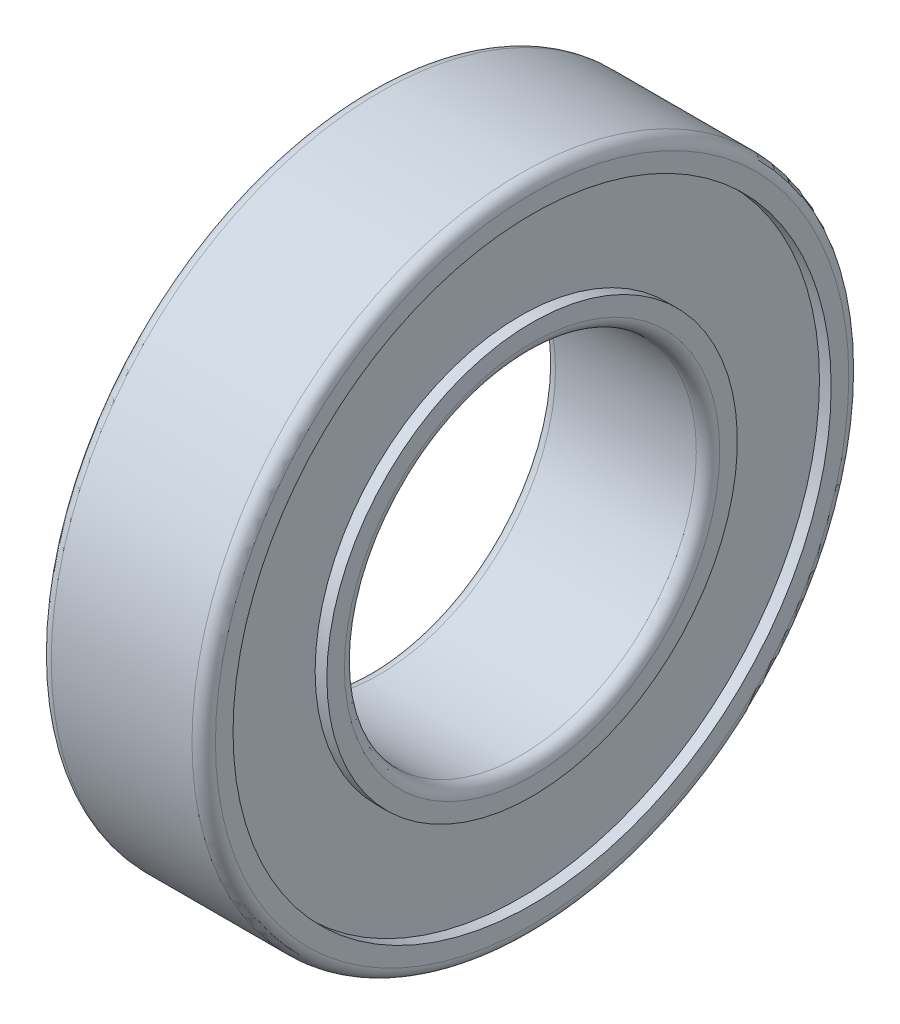
ISO-10303-21;
HEADER;
FILE_DESCRIPTION(('STEP AP214'),'2;1');
FILE_NAME('part.step','',(''),(''),'','','');
FILE_SCHEMA(('AUTOMOTIVE_DESIGN { 1 0 10303 214 1 1 1 1 }'));
ENDSEC;
DATA;
#1=APPLICATION_CONTEXT('core data for automotive mechanical design processes');
#2=APPLICATION_PROTOCOL_DEFINITION('international standard','automotive_design',2000,#1);
#3=PRODUCT_CONTEXT('',#1,'mechanical');
#4=PRODUCT('Part','Part','',(#3));
#5=PRODUCT_RELATED_PRODUCT_CATEGORY('part','',(#4));
#6=PRODUCT_DEFINITION_FORMATION('','',#4);
#7=PRODUCT_DEFINITION_CONTEXT('part definition',#1,'design');
#8=PRODUCT_DEFINITION('design','',#6,#7);
#9=PRODUCT_DEFINITION_SHAPE('','',#8);
#10=(LENGTH_UNIT() NAMED_UNIT(*) SI_UNIT(.MILLI.,.METRE.));
#11=(NAMED_UNIT(*) PLANE_ANGLE_UNIT() SI_UNIT($,.RADIAN.));
#12=(NAMED_UNIT(*) SI_UNIT($,.STERADIAN.) SOLID_ANGLE_UNIT());
#13=UNCERTAINTY_MEASURE_WITH_UNIT(LENGTH_MEASURE(1.E-05),#10,'distance_accuracy_value','');
#14=(GEOMETRIC_REPRESENTATION_CONTEXT(3) GLOBAL_UNCERTAINTY_ASSIGNED_CONTEXT((#13)) GLOBAL_UNIT_ASSIGNED_CONTEXT((#10,
#11,#12)) REPRESENTATION_CONTEXT('',''));
#15=CARTESIAN_POINT('',(0.,0.,0.));
#16=DIRECTION('',(0.,0.,1.));
#17=DIRECTION('',(1.,0.,0.));
#18=AXIS2_PLACEMENT_3D('',#15,#16,#17);
#19=CARTESIAN_POINT('',(0.5,12.75,0.));
#20=DIRECTION('',(1.,0.,0.));
#21=DIRECTION('',(0.,0.,-1.));
#22=AXIS2_PLACEMENT_3D('',#19,#20,#21);
#23=PLANE('',#22);
#24=CARTESIAN_POINT('',(0.5,0.,0.));
#25=DIRECTION('',(-1.,0.,0.));
#26=DIRECTION('',(0.,0.,1.));
#27=AXIS2_PLACEMENT_3D('',#24,#25,#26);
#28=CIRCLE('',#27,12.75);
#29=CARTESIAN_POINT('',(0.5,0.,12.75));
#30=VERTEX_POINT('',#29);
#31=EDGE_CURVE('E342',#30,#30,#28,.T.);
#32=ORIENTED_EDGE('',*,*,#31,.T.);
#33=EDGE_LOOP('',(#32));
#34=FACE_BOUND('',#33,.T.);
#35=CARTESIAN_POINT('',(0.5,0.,0.));
#36=DIRECTION('',(-1.,0.,0.));
#37=DIRECTION('',(0.,0.,1.));
#38=AXIS2_PLACEMENT_3D('',#35,#36,#37);
#39=CIRCLE('',#38,8.75);
#40=CARTESIAN_POINT('',(0.5,0.,8.75));
#41=VERTEX_POINT('',#40);
#42=EDGE_CURVE('E337',#41,#41,#39,.T.);
#43=ORIENTED_EDGE('',*,*,#42,.F.);
#44=EDGE_LOOP('',(#43));
#45=FACE_BOUND('',#44,.T.);
#46=ADVANCED_FACE('F16',(#34,#45),#23,.F.);
#47=CARTESIAN_POINT('',(0.,0.,0.));
#48=DIRECTION('',(-1.,0.,0.));
#49=DIRECTION('',(0.,0.,1.));
#50=AXIS2_PLACEMENT_3D('',#47,#48,#49);
#51=CYLINDRICAL_SURFACE('',#50,12.75);
#52=ORIENTED_EDGE('',*,*,#31,.F.);
#53=EDGE_LOOP('',(#52));
#54=FACE_BOUND('',#53,.T.);
#55=CARTESIAN_POINT('',(0.,0.,0.));
#56=DIRECTION('',(-1.,0.,0.));
#57=DIRECTION('',(0.,0.,1.));
#58=AXIS2_PLACEMENT_3D('',#55,#56,#57);
#59=CIRCLE('',#58,12.75);
#60=CARTESIAN_POINT('',(0.,0.,12.75));
#61=VERTEX_POINT('',#60);
#62=EDGE_CURVE('E333',#61,#61,#59,.T.);
#63=ORIENTED_EDGE('',*,*,#62,.T.);
#64=EDGE_LOOP('',(#63));
#65=FACE_BOUND('',#64,.T.);
#66=ADVANCED_FACE('F113',(#54,#65),#51,.F.);
#67=CARTESIAN_POINT('',(0.,0.,0.));
#68=DIRECTION('',(-1.,0.,0.));
#69=DIRECTION('',(0.,0.,1.));
#70=AXIS2_PLACEMENT_3D('',#67,#68,#69);
#71=CYLINDRICAL_SURFACE('',#70,8.75);
#72=CARTESIAN_POINT('',(0.,0.,0.));
#73=DIRECTION('',(-1.,0.,0.));
#74=DIRECTION('',(0.,0.,1.));
#75=AXIS2_PLACEMENT_3D('',#72,#73,#74);
#76=CIRCLE('',#75,8.75);
#77=CARTESIAN_POINT('',(0.,0.,8.75));
#78=VERTEX_POINT('',#77);
#79=EDGE_CURVE('E81',#78,#78,#76,.F.);
#80=ORIENTED_EDGE('',*,*,#79,.T.);
#81=EDGE_LOOP('',(#80));
#82=FACE_BOUND('',#81,.T.);
#83=ORIENTED_EDGE('',*,*,#42,.T.);
#84=EDGE_LOOP('',(#83));
#85=FACE_BOUND('',#84,.T.);
#86=ADVANCED_FACE('F101',(#82,#85),#71,.T.);
#87=CARTESIAN_POINT('',(0.,14.,0.));
#88=DIRECTION('',(1.,0.,0.));
#89=DIRECTION('',(0.,0.,-1.));
#90=AXIS2_PLACEMENT_3D('',#87,#88,#89);
#91=PLANE('',#90);
#92=ORIENTED_EDGE('',*,*,#62,.F.);
#93=EDGE_LOOP('',(#92));
#94=FACE_BOUND('',#93,.T.);
#95=CARTESIAN_POINT('',(0.,0.,0.));
#96=DIRECTION('',(1.,0.,0.));
#97=DIRECTION('',(0.,0.,-1.));
#98=AXIS2_PLACEMENT_3D('',#95,#96,#97);
#99=CIRCLE('',#98,13.5);
#100=CARTESIAN_POINT('',(0.,0.,-13.5));
#101=VERTEX_POINT('',#100);
#102=CARTESIAN_POINT('',(0.,0.,13.5));
#103=VERTEX_POINT('',#102);
#104=EDGE_CURVE('E65',#101,#103,#99,.T.);
#105=ORIENTED_EDGE('',*,*,#104,.F.);
#106=CARTESIAN_POINT('',(0.,0.,0.));
#107=DIRECTION('',(1.,0.,0.));
#108=DIRECTION('',(0.,0.,1.));
#109=AXIS2_PLACEMENT_3D('',#106,#107,#108);
#110=CIRCLE('',#109,13.5);
#111=EDGE_CURVE('E68',#103,#101,#110,.T.);
#112=ORIENTED_EDGE('',*,*,#111,.F.);
#113=EDGE_LOOP('',(#105,#112));
#114=FACE_BOUND('',#113,.T.);
#115=ADVANCED_FACE('F79',(#94,#114),#91,.F.);
#116=CARTESIAN_POINT('',(0.,8.75,0.));
#117=DIRECTION('',(1.,0.,0.));
#118=DIRECTION('',(0.,0.,-1.));
#119=AXIS2_PLACEMENT_3D('',#116,#117,#118);
#120=PLANE('',#119);
#121=ORIENTED_EDGE('',*,*,#79,.F.);
#122=EDGE_LOOP('',(#121));
#123=FACE_BOUND('',#122,.T.);
#124=CARTESIAN_POINT('',(0.,0.,0.));
#125=DIRECTION('',(-1.,0.,0.));
#126=DIRECTION('',(0.,0.,-1.));
#127=AXIS2_PLACEMENT_3D('',#124,#125,#126);
#128=CIRCLE('',#127,8.);
#129=CARTESIAN_POINT('',(0.,0.,-8.));
#130=VERTEX_POINT('',#129);
#131=CARTESIAN_POINT('',(0.,0.,8.));
#132=VERTEX_POINT('',#131);
#133=EDGE_CURVE('E75',#130,#132,#128,.T.);
#134=ORIENTED_EDGE('',*,*,#133,.F.);
#135=CARTESIAN_POINT('',(0.,0.,0.));
#136=DIRECTION('',(-1.,0.,0.));
#137=DIRECTION('',(0.,0.,1.));
#138=AXIS2_PLACEMENT_3D('',#135,#136,#137);
#139=CIRCLE('',#138,8.);
#140=EDGE_CURVE('E253',#132,#130,#139,.T.);
#141=ORIENTED_EDGE('',*,*,#140,.F.);
#142=EDGE_LOOP('',(#134,#141));
#143=FACE_BOUND('',#142,.T.);
#144=ADVANCED_FACE('F100',(#123,#143),#120,.F.);
#145=CARTESIAN_POINT('',(0.500000000000002,0.,0.));
#146=DIRECTION('',(1.,0.,0.));
#147=DIRECTION('',(0.,0.,-1.));
#148=AXIS2_PLACEMENT_3D('',#145,#146,#147);
#149=TOROIDAL_SURFACE('',#148,13.5,0.5);
#150=ORIENTED_EDGE('',*,*,#104,.T.);
#151=ORIENTED_EDGE('',*,*,#111,.T.);
#152=EDGE_LOOP('',(#150,#151));
#153=FACE_BOUND('',#152,.T.);
#154=CARTESIAN_POINT('',(0.500000000000002,0.,0.));
#155=DIRECTION('',(-1.,0.,0.));
#156=DIRECTION('',(0.,0.,1.));
#157=AXIS2_PLACEMENT_3D('',#154,#155,#156);
#158=CIRCLE('',#157,14.);
#159=CARTESIAN_POINT('',(0.500000000000002,0.,14.));
#160=VERTEX_POINT('',#159);
#161=EDGE_CURVE('E249',#160,#160,#158,.F.);
#162=ORIENTED_EDGE('',*,*,#161,.F.);
#163=EDGE_LOOP('',(#162));
#164=FACE_BOUND('',#163,.T.);
#165=ADVANCED_FACE('F70',(#153,#164),#149,.T.);
#166=CARTESIAN_POINT('',(0.5,0.,0.));
#167=DIRECTION('',(1.,0.,0.));
#168=DIRECTION('',(0.,0.,-1.));
#169=AXIS2_PLACEMENT_3D('',#166,#167,#168);
#170=TOROIDAL_SURFACE('',#169,8.,0.5);
#171=ORIENTED_EDGE('',*,*,#133,.T.);
#172=ORIENTED_EDGE('',*,*,#140,.T.);
#173=EDGE_LOOP('',(#171,#172));
#174=FACE_BOUND('',#173,.T.);
#175=CARTESIAN_POINT('',(0.5,0.,0.));
#176=DIRECTION('',(-1.,0.,0.));
#177=DIRECTION('',(0.,0.,1.));
#178=AXIS2_PLACEMENT_3D('',#175,#176,#177);
#179=CIRCLE('',#178,7.5);
#180=CARTESIAN_POINT('',(0.5,0.,7.5));
#181=VERTEX_POINT('',#180);
#182=EDGE_CURVE('E245',#181,#181,#179,.F.);
#183=ORIENTED_EDGE('',*,*,#182,.T.);
#184=EDGE_LOOP('',(#183));
#185=FACE_BOUND('',#184,.T.);
#186=ADVANCED_FACE('F230',(#174,#185),#170,.T.);
#187=CARTESIAN_POINT('',(0.,0.,0.));
#188=DIRECTION('',(-1.,0.,0.));
#189=DIRECTION('',(0.,0.,1.));
#190=AXIS2_PLACEMENT_3D('',#187,#188,#189);
#191=CYLINDRICAL_SURFACE('',#190,14.);
#192=CARTESIAN_POINT('',(6.5,0.,0.));
#193=DIRECTION('',(-1.,0.,0.));
#194=DIRECTION('',(0.,0.,1.));
#195=AXIS2_PLACEMENT_3D('',#192,#193,#194);
#196=CIRCLE('',#195,14.);
#197=CARTESIAN_POINT('',(6.5,0.,14.));
#198=VERTEX_POINT('',#197);
#199=EDGE_CURVE('E284',#198,#198,#196,.F.);
#200=ORIENTED_EDGE('',*,*,#199,.F.);
#201=EDGE_LOOP('',(#200));
#202=FACE_BOUND('',#201,.T.);
#203=ORIENTED_EDGE('',*,*,#161,.T.);
#204=EDGE_LOOP('',(#203));
#205=FACE_BOUND('',#204,.T.);
#206=ADVANCED_FACE('F239',(#202,#205),#191,.T.);
#207=CARTESIAN_POINT('',(0.,0.,0.));
#208=DIRECTION('',(-1.,0.,0.));
#209=DIRECTION('',(0.,0.,1.));
#210=AXIS2_PLACEMENT_3D('',#207,#208,#209);
#211=CYLINDRICAL_SURFACE('',#210,7.5);
#212=CARTESIAN_POINT('',(6.5,0.,0.));
#213=DIRECTION('',(-1.,0.,0.));
#214=DIRECTION('',(0.,0.,1.));
#215=AXIS2_PLACEMENT_3D('',#212,#213,#214);
#216=CIRCLE('',#215,7.5);
#217=CARTESIAN_POINT('',(6.5,0.,7.5));
#218=VERTEX_POINT('',#217);
#219=EDGE_CURVE('E281',#218,#218,#216,.T.);
#220=ORIENTED_EDGE('',*,*,#219,.F.);
#221=EDGE_LOOP('',(#220));
#222=FACE_BOUND('',#221,.T.);
#223=ORIENTED_EDGE('',*,*,#182,.F.);
#224=EDGE_LOOP('',(#223));
#225=FACE_BOUND('',#224,.T.);
#226=ADVANCED_FACE('F313',(#222,#225),#211,.F.);
#227=CARTESIAN_POINT('',(6.5,0.,0.));
#228=DIRECTION('',(-1.,0.,0.));
#229=DIRECTION('',(0.,0.,1.));
#230=AXIS2_PLACEMENT_3D('',#227,#228,#229);
#231=TOROIDAL_SURFACE('',#230,13.5,0.5);
#232=CARTESIAN_POINT('',(7.,0.,0.));
#233=DIRECTION('',(-1.,0.,0.));
#234=DIRECTION('',(0.,0.,1.));
#235=AXIS2_PLACEMENT_3D('',#232,#233,#234);
#236=CIRCLE('',#235,13.5);
#237=CARTESIAN_POINT('',(7.,0.,13.5));
#238=VERTEX_POINT('',#237);
#239=CARTESIAN_POINT('',(7.,0.,-13.5));
#240=VERTEX_POINT('',#239);
#241=EDGE_CURVE('E168',#238,#240,#236,.T.);
#242=ORIENTED_EDGE('',*,*,#241,.T.);
#243=CARTESIAN_POINT('',(7.,0.,0.));
#244=DIRECTION('',(-1.,0.,0.));
#245=DIRECTION('',(0.,0.,-1.));
#246=AXIS2_PLACEMENT_3D('',#243,#244,#245);
#247=CIRCLE('',#246,13.5);
#248=EDGE_CURVE('E179',#240,#238,#247,.T.);
#249=ORIENTED_EDGE('',*,*,#248,.T.);
#250=EDGE_LOOP('',(#242,#249));
#251=FACE_BOUND('',#250,.T.);
#252=ORIENTED_EDGE('',*,*,#199,.T.);
#253=EDGE_LOOP('',(#252));
#254=FACE_BOUND('',#253,.T.);
#255=ADVANCED_FACE('F195',(#251,#254),#231,.T.);
#256=CARTESIAN_POINT('',(6.5,0.,0.));
#257=DIRECTION('',(-1.,0.,0.));
#258=DIRECTION('',(0.,0.,1.));
#259=AXIS2_PLACEMENT_3D('',#256,#257,#258);
#260=TOROIDAL_SURFACE('',#259,8.,0.5);
#261=CARTESIAN_POINT('',(7.,0.,0.));
#262=DIRECTION('',(1.,0.,0.));
#263=DIRECTION('',(0.,0.,1.));
#264=AXIS2_PLACEMENT_3D('',#261,#262,#263);
#265=CIRCLE('',#264,8.);
#266=CARTESIAN_POINT('',(7.,0.,8.));
#267=VERTEX_POINT('',#266);
#268=CARTESIAN_POINT('',(7.,0.,-8.));
#269=VERTEX_POINT('',#268);
#270=EDGE_CURVE('E288',#267,#269,#265,.T.);
#271=ORIENTED_EDGE('',*,*,#270,.T.);
#272=CARTESIAN_POINT('',(7.,0.,0.));
#273=DIRECTION('',(1.,0.,0.));
#274=DIRECTION('',(0.,0.,-1.));
#275=AXIS2_PLACEMENT_3D('',#272,#273,#274);
#276=CIRCLE('',#275,8.);
#277=EDGE_CURVE('E40',#269,#267,#276,.T.);
#278=ORIENTED_EDGE('',*,*,#277,.T.);
#279=EDGE_LOOP('',(#271,#278));
#280=FACE_BOUND('',#279,.T.);
#281=ORIENTED_EDGE('',*,*,#219,.T.);
#282=EDGE_LOOP('',(#281));
#283=FACE_BOUND('',#282,.T.);
#284=ADVANCED_FACE('F191',(#280,#283),#260,.T.);
#285=CARTESIAN_POINT('',(7.,12.75,0.));
#286=DIRECTION('',(-1.,0.,0.));
#287=DIRECTION('',(0.,0.,1.));
#288=AXIS2_PLACEMENT_3D('',#285,#286,#287);
#289=PLANE('',#288);
#290=CARTESIAN_POINT('',(7.,0.,0.));
#291=DIRECTION('',(-1.,0.,0.));
#292=DIRECTION('',(0.,0.,1.));
#293=AXIS2_PLACEMENT_3D('',#290,#291,#292);
#294=CIRCLE('',#293,12.75);
#295=CARTESIAN_POINT('',(7.,0.,12.75));
#296=VERTEX_POINT('',#295);
#297=EDGE_CURVE('E287',#296,#296,#294,.T.);
#298=ORIENTED_EDGE('',*,*,#297,.T.);
#299=EDGE_LOOP('',(#298));
#300=FACE_BOUND('',#299,.T.);
#301=ORIENTED_EDGE('',*,*,#241,.F.);
#302=ORIENTED_EDGE('',*,*,#248,.F.);
#303=EDGE_LOOP('',(#301,#302));
#304=FACE_BOUND('',#303,.T.);
#305=ADVANCED_FACE('F147',(#300,#304),#289,.F.);
#306=CARTESIAN_POINT('',(7.,7.5,0.));
#307=DIRECTION('',(-1.,0.,0.));
#308=DIRECTION('',(0.,0.,1.));
#309=AXIS2_PLACEMENT_3D('',#306,#307,#308);
#310=PLANE('',#309);
#311=CARTESIAN_POINT('',(7.,0.,0.));
#312=DIRECTION('',(-1.,0.,0.));
#313=DIRECTION('',(0.,0.,1.));
#314=AXIS2_PLACEMENT_3D('',#311,#312,#313);
#315=CIRCLE('',#314,8.75);
#316=CARTESIAN_POINT('',(7.,0.,8.75));
#317=VERTEX_POINT('',#316);
#318=EDGE_CURVE('E289',#317,#317,#315,.T.);
#319=ORIENTED_EDGE('',*,*,#318,.F.);
#320=EDGE_LOOP('',(#319));
#321=FACE_BOUND('',#320,.T.);
#322=ORIENTED_EDGE('',*,*,#270,.F.);
#323=ORIENTED_EDGE('',*,*,#277,.F.);
#324=EDGE_LOOP('',(#322,#323));
#325=FACE_BOUND('',#324,.T.);
#326=ADVANCED_FACE('F142',(#321,#325),#310,.F.);
#327=CARTESIAN_POINT('',(0.,0.,0.));
#328=DIRECTION('',(-1.,0.,0.));
#329=DIRECTION('',(0.,0.,1.));
#330=AXIS2_PLACEMENT_3D('',#327,#328,#329);
#331=CYLINDRICAL_SURFACE('',#330,12.75);
#332=ORIENTED_EDGE('',*,*,#297,.F.);
#333=EDGE_LOOP('',(#332));
#334=FACE_BOUND('',#333,.T.);
#335=CARTESIAN_POINT('',(6.5,0.,0.));
#336=DIRECTION('',(-1.,0.,0.));
#337=DIRECTION('',(0.,0.,1.));
#338=AXIS2_PLACEMENT_3D('',#335,#336,#337);
#339=CIRCLE('',#338,12.75);
#340=CARTESIAN_POINT('',(6.5,0.,12.75));
#341=VERTEX_POINT('',#340);
#342=EDGE_CURVE('E28',#341,#341,#339,.T.);
#343=ORIENTED_EDGE('',*,*,#342,.T.);
#344=EDGE_LOOP('',(#343));
#345=FACE_BOUND('',#344,.T.);
#346=ADVANCED_FACE('F134',(#334,#345),#331,.F.);
#347=CARTESIAN_POINT('',(0.,0.,0.));
#348=DIRECTION('',(-1.,0.,0.));
#349=DIRECTION('',(0.,0.,1.));
#350=AXIS2_PLACEMENT_3D('',#347,#348,#349);
#351=CYLINDRICAL_SURFACE('',#350,8.75);
#352=CARTESIAN_POINT('',(6.5,0.,0.));
#353=DIRECTION('',(-1.,0.,0.));
#354=DIRECTION('',(0.,0.,1.));
#355=AXIS2_PLACEMENT_3D('',#352,#353,#354);
#356=CIRCLE('',#355,8.75);
#357=CARTESIAN_POINT('',(6.5,0.,8.75));
#358=VERTEX_POINT('',#357);
#359=EDGE_CURVE('E11',#358,#358,#356,.F.);
#360=ORIENTED_EDGE('',*,*,#359,.T.);
#361=EDGE_LOOP('',(#360));
#362=FACE_BOUND('',#361,.T.);
#363=ORIENTED_EDGE('',*,*,#318,.T.);
#364=EDGE_LOOP('',(#363));
#365=FACE_BOUND('',#364,.T.);
#366=ADVANCED_FACE('F127',(#362,#365),#351,.T.);
#367=CARTESIAN_POINT('',(6.5,8.75,0.));
#368=DIRECTION('',(-1.,0.,0.));
#369=DIRECTION('',(0.,0.,1.));
#370=AXIS2_PLACEMENT_3D('',#367,#368,#369);
#371=PLANE('',#370);
#372=ORIENTED_EDGE('',*,*,#359,.F.);
#373=EDGE_LOOP('',(#372));
#374=FACE_BOUND('',#373,.T.);
#375=ORIENTED_EDGE('',*,*,#342,.F.);
#376=EDGE_LOOP('',(#375));
#377=FACE_BOUND('',#376,.T.);
#378=ADVANCED_FACE('F125',(#374,#377),#371,.F.);
#379=CLOSED_SHELL('',(#46,#66,#86,#115,#144,#165,#186,#206,#226,#255,#284,#305,#326,#346,#366,#378));
#380=MANIFOLD_SOLID_BREP('B1',#379);
#381=ADVANCED_BREP_SHAPE_REPRESENTATION('',(#18,#380),#14);
#382=SHAPE_DEFINITION_REPRESENTATION(#9,#381);
ENDSEC;
END-ISO-10303-21;
